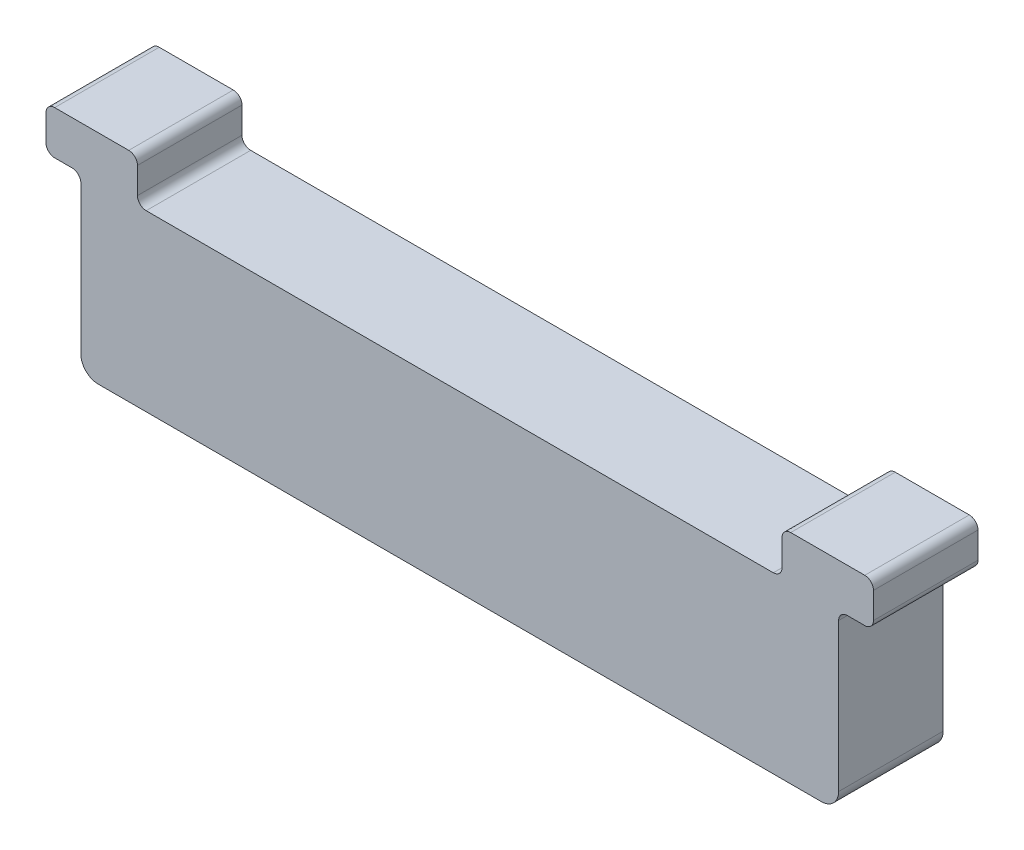
ISO-10303-21;
HEADER;
FILE_DESCRIPTION(('STEP AP214'),'2;1');
FILE_NAME('part.step','',(''),(''),'','','');
FILE_SCHEMA(('AUTOMOTIVE_DESIGN { 1 0 10303 214 1 1 1 1 }'));
ENDSEC;
DATA;
#1=APPLICATION_CONTEXT('core data for automotive mechanical design processes');
#2=APPLICATION_PROTOCOL_DEFINITION('international standard','automotive_design',2000,#1);
#3=PRODUCT_CONTEXT('',#1,'mechanical');
#4=PRODUCT('Part','Part','',(#3));
#5=PRODUCT_RELATED_PRODUCT_CATEGORY('part','',(#4));
#6=PRODUCT_DEFINITION_FORMATION('','',#4);
#7=PRODUCT_DEFINITION_CONTEXT('part definition',#1,'design');
#8=PRODUCT_DEFINITION('design','',#6,#7);
#9=PRODUCT_DEFINITION_SHAPE('','',#8);
#10=(LENGTH_UNIT() NAMED_UNIT(*) SI_UNIT(.MILLI.,.METRE.));
#11=(NAMED_UNIT(*) PLANE_ANGLE_UNIT() SI_UNIT($,.RADIAN.));
#12=(NAMED_UNIT(*) SI_UNIT($,.STERADIAN.) SOLID_ANGLE_UNIT());
#13=UNCERTAINTY_MEASURE_WITH_UNIT(LENGTH_MEASURE(1.E-05),#10,'distance_accuracy_value','');
#14=(GEOMETRIC_REPRESENTATION_CONTEXT(3) GLOBAL_UNCERTAINTY_ASSIGNED_CONTEXT((#13)) GLOBAL_UNIT_ASSIGNED_CONTEXT((#10,
#11,#12)) REPRESENTATION_CONTEXT('',''));
#15=CARTESIAN_POINT('',(0.,0.,0.));
#16=DIRECTION('',(0.,0.,1.));
#17=DIRECTION('',(1.,0.,0.));
#18=AXIS2_PLACEMENT_3D('',#15,#16,#17);
#19=CARTESIAN_POINT('',(20.75,1.,6.));
#20=DIRECTION('',(0.,0.,-1.));
#21=DIRECTION('',(-1.,0.,0.));
#22=AXIS2_PLACEMENT_3D('',#19,#20,#21);
#23=CYLINDRICAL_SURFACE('',#22,1.);
#24=CARTESIAN_POINT('',(20.75,1.,0.));
#25=DIRECTION('',(0.,0.,1.));
#26=DIRECTION('',(-1.,0.,0.));
#27=AXIS2_PLACEMENT_3D('',#24,#25,#26);
#28=CIRCLE('',#27,1.);
#29=CARTESIAN_POINT('',(20.75,0.,0.));
#30=VERTEX_POINT('',#29);
#31=CARTESIAN_POINT('',(21.75,1.,0.));
#32=VERTEX_POINT('',#31);
#33=EDGE_CURVE('E231',#30,#32,#28,.T.);
#34=ORIENTED_EDGE('',*,*,#33,.T.);
#35=DIRECTION('',(0.,0.,-1.));
#36=VECTOR('',#35,1.);
#37=CARTESIAN_POINT('',(21.75,1.,6.));
#38=LINE('',#37,#36);
#39=CARTESIAN_POINT('',(21.75,1.,6.));
#40=VERTEX_POINT('',#39);
#41=EDGE_CURVE('E11',#40,#32,#38,.T.);
#42=ORIENTED_EDGE('',*,*,#41,.F.);
#43=CARTESIAN_POINT('',(20.75,1.,6.));
#44=DIRECTION('',(0.,0.,1.));
#45=DIRECTION('',(-1.,0.,0.));
#46=AXIS2_PLACEMENT_3D('',#43,#44,#45);
#47=CIRCLE('',#46,1.);
#48=CARTESIAN_POINT('',(20.75,0.,6.));
#49=VERTEX_POINT('',#48);
#50=EDGE_CURVE('E277',#49,#40,#47,.T.);
#51=ORIENTED_EDGE('',*,*,#50,.F.);
#52=DIRECTION('',(0.,0.,-1.));
#53=VECTOR('',#52,1.);
#54=CARTESIAN_POINT('',(20.75,0.,6.));
#55=LINE('',#54,#53);
#56=EDGE_CURVE('E227',#49,#30,#55,.T.);
#57=ORIENTED_EDGE('',*,*,#56,.T.);
#58=EDGE_LOOP('',(#34,#42,#51,#57));
#59=FACE_BOUND('',#58,.T.);
#60=ADVANCED_FACE('F39',(#59),#23,.T.);
#61=CARTESIAN_POINT('',(21.75,9.5,6.));
#62=DIRECTION('',(-1.,0.,0.));
#63=DIRECTION('',(0.,0.,1.));
#64=AXIS2_PLACEMENT_3D('',#61,#62,#63);
#65=PLANE('',#64);
#66=DIRECTION('',(0.,1.,0.));
#67=VECTOR('',#66,1.);
#68=CARTESIAN_POINT('',(21.75,9.5,0.));
#69=LINE('',#68,#67);
#70=CARTESIAN_POINT('',(21.75,9.5,0.));
#71=VERTEX_POINT('',#70);
#72=EDGE_CURVE('E234',#32,#71,#69,.T.);
#73=ORIENTED_EDGE('',*,*,#72,.T.);
#74=DIRECTION('',(0.,0.,-1.));
#75=VECTOR('',#74,1.);
#76=CARTESIAN_POINT('',(21.75,9.5,6.));
#77=LINE('',#76,#75);
#78=CARTESIAN_POINT('',(21.75,9.5,6.));
#79=VERTEX_POINT('',#78);
#80=EDGE_CURVE('E47',#79,#71,#77,.T.);
#81=ORIENTED_EDGE('',*,*,#80,.F.);
#82=DIRECTION('',(0.,1.,0.));
#83=VECTOR('',#82,1.);
#84=CARTESIAN_POINT('',(21.75,9.5,6.));
#85=LINE('',#84,#83);
#86=EDGE_CURVE('E146',#40,#79,#85,.T.);
#87=ORIENTED_EDGE('',*,*,#86,.F.);
#88=ORIENTED_EDGE('',*,*,#41,.T.);
#89=EDGE_LOOP('',(#73,#81,#87,#88));
#90=FACE_BOUND('',#89,.T.);
#91=ADVANCED_FACE('F415',(#90),#65,.F.);
#92=CARTESIAN_POINT('',(22.25,9.5,6.));
#93=DIRECTION('',(0.,0.,-1.));
#94=DIRECTION('',(-1.,0.,0.));
#95=AXIS2_PLACEMENT_3D('',#92,#93,#94);
#96=CYLINDRICAL_SURFACE('',#95,0.5);
#97=CARTESIAN_POINT('',(22.25,9.5,0.));
#98=DIRECTION('',(0.,0.,-1.));
#99=DIRECTION('',(1.,0.,0.));
#100=AXIS2_PLACEMENT_3D('',#97,#98,#99);
#101=CIRCLE('',#100,0.5);
#102=CARTESIAN_POINT('',(22.25,10.,0.));
#103=VERTEX_POINT('',#102);
#104=EDGE_CURVE('E236',#71,#103,#101,.T.);
#105=ORIENTED_EDGE('',*,*,#104,.T.);
#106=DIRECTION('',(0.,0.,-1.));
#107=VECTOR('',#106,1.);
#108=CARTESIAN_POINT('',(22.25,10.,6.));
#109=LINE('',#108,#107);
#110=CARTESIAN_POINT('',(22.25,10.,6.));
#111=VERTEX_POINT('',#110);
#112=EDGE_CURVE('E332',#111,#103,#109,.T.);
#113=ORIENTED_EDGE('',*,*,#112,.F.);
#114=CARTESIAN_POINT('',(22.25,9.5,6.));
#115=DIRECTION('',(0.,0.,-1.));
#116=DIRECTION('',(1.,0.,0.));
#117=AXIS2_PLACEMENT_3D('',#114,#115,#116);
#118=CIRCLE('',#117,0.5);
#119=EDGE_CURVE('E340',#79,#111,#118,.T.);
#120=ORIENTED_EDGE('',*,*,#119,.F.);
#121=ORIENTED_EDGE('',*,*,#80,.T.);
#122=EDGE_LOOP('',(#105,#113,#120,#121));
#123=FACE_BOUND('',#122,.T.);
#124=ADVANCED_FACE('F338',(#123),#96,.F.);
#125=CARTESIAN_POINT('',(23.25,10.,6.));
#126=DIRECTION('',(0.,1.,0.));
#127=DIRECTION('',(0.,0.,1.));
#128=AXIS2_PLACEMENT_3D('',#125,#126,#127);
#129=PLANE('',#128);
#130=DIRECTION('',(1.,0.,0.));
#131=VECTOR('',#130,1.);
#132=CARTESIAN_POINT('',(23.25,10.,0.));
#133=LINE('',#132,#131);
#134=CARTESIAN_POINT('',(23.25,10.,0.));
#135=VERTEX_POINT('',#134);
#136=EDGE_CURVE('E238',#103,#135,#133,.T.);
#137=ORIENTED_EDGE('',*,*,#136,.T.);
#138=DIRECTION('',(0.,0.,-1.));
#139=VECTOR('',#138,1.);
#140=CARTESIAN_POINT('',(23.25,10.,6.));
#141=LINE('',#140,#139);
#142=CARTESIAN_POINT('',(23.25,10.,6.));
#143=VERTEX_POINT('',#142);
#144=EDGE_CURVE('E329',#143,#135,#141,.T.);
#145=ORIENTED_EDGE('',*,*,#144,.F.);
#146=DIRECTION('',(1.,0.,0.));
#147=VECTOR('',#146,1.);
#148=CARTESIAN_POINT('',(23.25,10.,6.));
#149=LINE('',#148,#147);
#150=EDGE_CURVE('E358',#111,#143,#149,.T.);
#151=ORIENTED_EDGE('',*,*,#150,.F.);
#152=ORIENTED_EDGE('',*,*,#112,.T.);
#153=EDGE_LOOP('',(#137,#145,#151,#152));
#154=FACE_BOUND('',#153,.T.);
#155=ADVANCED_FACE('F349',(#154),#129,.F.);
#156=CARTESIAN_POINT('',(23.25,10.5,6.));
#157=DIRECTION('',(0.,0.,-1.));
#158=DIRECTION('',(-1.,0.,0.));
#159=AXIS2_PLACEMENT_3D('',#156,#157,#158);
#160=CYLINDRICAL_SURFACE('',#159,0.5);
#161=CARTESIAN_POINT('',(23.25,10.5,0.));
#162=DIRECTION('',(0.,0.,1.));
#163=DIRECTION('',(1.,0.,0.));
#164=AXIS2_PLACEMENT_3D('',#161,#162,#163);
#165=CIRCLE('',#164,0.5);
#166=CARTESIAN_POINT('',(23.75,10.5,0.));
#167=VERTEX_POINT('',#166);
#168=EDGE_CURVE('E240',#135,#167,#165,.T.);
#169=ORIENTED_EDGE('',*,*,#168,.T.);
#170=DIRECTION('',(0.,0.,-1.));
#171=VECTOR('',#170,1.);
#172=CARTESIAN_POINT('',(23.75,10.5,6.));
#173=LINE('',#172,#171);
#174=CARTESIAN_POINT('',(23.75,10.5,6.));
#175=VERTEX_POINT('',#174);
#176=EDGE_CURVE('E326',#175,#167,#173,.T.);
#177=ORIENTED_EDGE('',*,*,#176,.F.);
#178=CARTESIAN_POINT('',(23.25,10.5,6.));
#179=DIRECTION('',(0.,0.,1.));
#180=DIRECTION('',(1.,0.,0.));
#181=AXIS2_PLACEMENT_3D('',#178,#179,#180);
#182=CIRCLE('',#181,0.5);
#183=EDGE_CURVE('E355',#143,#175,#182,.T.);
#184=ORIENTED_EDGE('',*,*,#183,.F.);
#185=ORIENTED_EDGE('',*,*,#144,.T.);
#186=EDGE_LOOP('',(#169,#177,#184,#185));
#187=FACE_BOUND('',#186,.T.);
#188=ADVANCED_FACE('F353',(#187),#160,.T.);
#189=CARTESIAN_POINT('',(23.75,10.5,6.));
#190=DIRECTION('',(-1.,0.,0.));
#191=DIRECTION('',(0.,0.,1.));
#192=AXIS2_PLACEMENT_3D('',#189,#190,#191);
#193=PLANE('',#192);
#194=DIRECTION('',(0.,1.,0.));
#195=VECTOR('',#194,1.);
#196=CARTESIAN_POINT('',(23.75,10.5,0.));
#197=LINE('',#196,#195);
#198=CARTESIAN_POINT('',(23.75,12.,0.));
#199=VERTEX_POINT('',#198);
#200=EDGE_CURVE('E242',#167,#199,#197,.T.);
#201=ORIENTED_EDGE('',*,*,#200,.T.);
#202=DIRECTION('',(0.,0.,-1.));
#203=VECTOR('',#202,1.);
#204=CARTESIAN_POINT('',(23.75,12.,6.));
#205=LINE('',#204,#203);
#206=CARTESIAN_POINT('',(23.75,12.,6.));
#207=VERTEX_POINT('',#206);
#208=EDGE_CURVE('E323',#207,#199,#205,.T.);
#209=ORIENTED_EDGE('',*,*,#208,.F.);
#210=DIRECTION('',(0.,1.,0.));
#211=VECTOR('',#210,1.);
#212=CARTESIAN_POINT('',(23.75,10.5,6.));
#213=LINE('',#212,#211);
#214=EDGE_CURVE('E357',#175,#207,#213,.T.);
#215=ORIENTED_EDGE('',*,*,#214,.F.);
#216=ORIENTED_EDGE('',*,*,#176,.T.);
#217=EDGE_LOOP('',(#201,#209,#215,#216));
#218=FACE_BOUND('',#217,.T.);
#219=ADVANCED_FACE('F428',(#218),#193,.F.);
#220=CARTESIAN_POINT('',(23.25,12.,6.));
#221=DIRECTION('',(0.,0.,-1.));
#222=DIRECTION('',(-1.,0.,0.));
#223=AXIS2_PLACEMENT_3D('',#220,#221,#222);
#224=CYLINDRICAL_SURFACE('',#223,0.5);
#225=CARTESIAN_POINT('',(23.25,12.,0.));
#226=DIRECTION('',(0.,0.,1.));
#227=DIRECTION('',(1.,0.,0.));
#228=AXIS2_PLACEMENT_3D('',#225,#226,#227);
#229=CIRCLE('',#228,0.5);
#230=CARTESIAN_POINT('',(23.25,12.5,0.));
#231=VERTEX_POINT('',#230);
#232=EDGE_CURVE('E244',#199,#231,#229,.T.);
#233=ORIENTED_EDGE('',*,*,#232,.T.);
#234=DIRECTION('',(0.,0.,-1.));
#235=VECTOR('',#234,1.);
#236=CARTESIAN_POINT('',(23.25,12.5,6.));
#237=LINE('',#236,#235);
#238=CARTESIAN_POINT('',(23.25,12.5,6.));
#239=VERTEX_POINT('',#238);
#240=EDGE_CURVE('E320',#239,#231,#237,.T.);
#241=ORIENTED_EDGE('',*,*,#240,.F.);
#242=CARTESIAN_POINT('',(23.25,12.,6.));
#243=DIRECTION('',(0.,0.,1.));
#244=DIRECTION('',(1.,0.,0.));
#245=AXIS2_PLACEMENT_3D('',#242,#243,#244);
#246=CIRCLE('',#245,0.5);
#247=EDGE_CURVE('E360',#207,#239,#246,.T.);
#248=ORIENTED_EDGE('',*,*,#247,.F.);
#249=ORIENTED_EDGE('',*,*,#208,.T.);
#250=EDGE_LOOP('',(#233,#241,#248,#249));
#251=FACE_BOUND('',#250,.T.);
#252=ADVANCED_FACE('F431',(#251),#224,.T.);
#253=CARTESIAN_POINT('',(23.25,12.5,6.));
#254=DIRECTION('',(0.,-1.,0.));
#255=DIRECTION('',(0.,0.,-1.));
#256=AXIS2_PLACEMENT_3D('',#253,#254,#255);
#257=PLANE('',#256);
#258=DIRECTION('',(-1.,0.,0.));
#259=VECTOR('',#258,1.);
#260=CARTESIAN_POINT('',(23.25,12.5,0.));
#261=LINE('',#260,#259);
#262=CARTESIAN_POINT('',(19.,12.5,0.));
#263=VERTEX_POINT('',#262);
#264=EDGE_CURVE('E246',#231,#263,#261,.T.);
#265=ORIENTED_EDGE('',*,*,#264,.T.);
#266=DIRECTION('',(0.,0.,-1.));
#267=VECTOR('',#266,1.);
#268=CARTESIAN_POINT('',(19.,12.5,6.));
#269=LINE('',#268,#267);
#270=CARTESIAN_POINT('',(19.,12.5,6.));
#271=VERTEX_POINT('',#270);
#272=EDGE_CURVE('E317',#271,#263,#269,.T.);
#273=ORIENTED_EDGE('',*,*,#272,.F.);
#274=DIRECTION('',(-1.,0.,0.));
#275=VECTOR('',#274,1.);
#276=CARTESIAN_POINT('',(23.25,12.5,6.));
#277=LINE('',#276,#275);
#278=EDGE_CURVE('E366',#239,#271,#277,.T.);
#279=ORIENTED_EDGE('',*,*,#278,.F.);
#280=ORIENTED_EDGE('',*,*,#240,.T.);
#281=EDGE_LOOP('',(#265,#273,#279,#280));
#282=FACE_BOUND('',#281,.T.);
#283=ADVANCED_FACE('F435',(#282),#257,.F.);
#284=CARTESIAN_POINT('',(19.,12.,6.));
#285=DIRECTION('',(0.,0.,-1.));
#286=DIRECTION('',(-1.,0.,0.));
#287=AXIS2_PLACEMENT_3D('',#284,#285,#286);
#288=CYLINDRICAL_SURFACE('',#287,0.5);
#289=CARTESIAN_POINT('',(19.,12.,0.));
#290=DIRECTION('',(0.,0.,1.));
#291=DIRECTION('',(1.,0.,0.));
#292=AXIS2_PLACEMENT_3D('',#289,#290,#291);
#293=CIRCLE('',#292,0.5);
#294=CARTESIAN_POINT('',(18.5,12.,0.));
#295=VERTEX_POINT('',#294);
#296=EDGE_CURVE('E248',#263,#295,#293,.T.);
#297=ORIENTED_EDGE('',*,*,#296,.T.);
#298=DIRECTION('',(0.,0.,-1.));
#299=VECTOR('',#298,1.);
#300=CARTESIAN_POINT('',(18.5,12.,6.));
#301=LINE('',#300,#299);
#302=CARTESIAN_POINT('',(18.5,12.,6.));
#303=VERTEX_POINT('',#302);
#304=EDGE_CURVE('E314',#303,#295,#301,.T.);
#305=ORIENTED_EDGE('',*,*,#304,.F.);
#306=CARTESIAN_POINT('',(19.,12.,6.));
#307=DIRECTION('',(0.,0.,1.));
#308=DIRECTION('',(1.,0.,0.));
#309=AXIS2_PLACEMENT_3D('',#306,#307,#308);
#310=CIRCLE('',#309,0.5);
#311=EDGE_CURVE('E368',#271,#303,#310,.T.);
#312=ORIENTED_EDGE('',*,*,#311,.F.);
#313=ORIENTED_EDGE('',*,*,#272,.T.);
#314=EDGE_LOOP('',(#297,#305,#312,#313));
#315=FACE_BOUND('',#314,.T.);
#316=ADVANCED_FACE('F439',(#315),#288,.T.);
#317=CARTESIAN_POINT('',(18.5,12.,6.));
#318=DIRECTION('',(1.,0.,0.));
#319=DIRECTION('',(0.,0.,-1.));
#320=AXIS2_PLACEMENT_3D('',#317,#318,#319);
#321=PLANE('',#320);
#322=DIRECTION('',(0.,-1.,0.));
#323=VECTOR('',#322,1.);
#324=CARTESIAN_POINT('',(18.5,12.,0.));
#325=LINE('',#324,#323);
#326=CARTESIAN_POINT('',(18.5,10.5,0.));
#327=VERTEX_POINT('',#326);
#328=EDGE_CURVE('E250',#295,#327,#325,.T.);
#329=ORIENTED_EDGE('',*,*,#328,.T.);
#330=DIRECTION('',(0.,0.,-1.));
#331=VECTOR('',#330,1.);
#332=CARTESIAN_POINT('',(18.5,10.5,6.));
#333=LINE('',#332,#331);
#334=CARTESIAN_POINT('',(18.5,10.5,6.));
#335=VERTEX_POINT('',#334);
#336=EDGE_CURVE('E311',#335,#327,#333,.T.);
#337=ORIENTED_EDGE('',*,*,#336,.F.);
#338=DIRECTION('',(0.,-1.,0.));
#339=VECTOR('',#338,1.);
#340=CARTESIAN_POINT('',(18.5,12.,6.));
#341=LINE('',#340,#339);
#342=EDGE_CURVE('E370',#303,#335,#341,.T.);
#343=ORIENTED_EDGE('',*,*,#342,.F.);
#344=ORIENTED_EDGE('',*,*,#304,.T.);
#345=EDGE_LOOP('',(#329,#337,#343,#344));
#346=FACE_BOUND('',#345,.T.);
#347=ADVANCED_FACE('F443',(#346),#321,.F.);
#348=CARTESIAN_POINT('',(18.,10.5,6.));
#349=DIRECTION('',(0.,0.,-1.));
#350=DIRECTION('',(-1.,0.,0.));
#351=AXIS2_PLACEMENT_3D('',#348,#349,#350);
#352=CYLINDRICAL_SURFACE('',#351,0.5);
#353=CARTESIAN_POINT('',(18.,10.5,0.));
#354=DIRECTION('',(0.,0.,-1.));
#355=DIRECTION('',(-1.,0.,0.));
#356=AXIS2_PLACEMENT_3D('',#353,#354,#355);
#357=CIRCLE('',#356,0.5);
#358=CARTESIAN_POINT('',(18.,10.,0.));
#359=VERTEX_POINT('',#358);
#360=EDGE_CURVE('E252',#327,#359,#357,.T.);
#361=ORIENTED_EDGE('',*,*,#360,.T.);
#362=DIRECTION('',(0.,0.,-1.));
#363=VECTOR('',#362,1.);
#364=CARTESIAN_POINT('',(18.,10.,6.));
#365=LINE('',#364,#363);
#366=CARTESIAN_POINT('',(18.,10.,6.));
#367=VERTEX_POINT('',#366);
#368=EDGE_CURVE('E308',#367,#359,#365,.T.);
#369=ORIENTED_EDGE('',*,*,#368,.F.);
#370=CARTESIAN_POINT('',(18.,10.5,6.));
#371=DIRECTION('',(0.,0.,-1.));
#372=DIRECTION('',(-1.,0.,0.));
#373=AXIS2_PLACEMENT_3D('',#370,#371,#372);
#374=CIRCLE('',#373,0.5);
#375=EDGE_CURVE('E372',#335,#367,#374,.T.);
#376=ORIENTED_EDGE('',*,*,#375,.F.);
#377=ORIENTED_EDGE('',*,*,#336,.T.);
#378=EDGE_LOOP('',(#361,#369,#376,#377));
#379=FACE_BOUND('',#378,.T.);
#380=ADVANCED_FACE('F447',(#379),#352,.F.);
#381=CARTESIAN_POINT('',(18.,10.,6.));
#382=DIRECTION('',(0.,-1.,0.));
#383=DIRECTION('',(0.,0.,-1.));
#384=AXIS2_PLACEMENT_3D('',#381,#382,#383);
#385=PLANE('',#384);
#386=DIRECTION('',(-1.,0.,0.));
#387=VECTOR('',#386,1.);
#388=CARTESIAN_POINT('',(18.,10.,0.));
#389=LINE('',#388,#387);
#390=CARTESIAN_POINT('',(-18.,10.,0.));
#391=VERTEX_POINT('',#390);
#392=EDGE_CURVE('E254',#359,#391,#389,.T.);
#393=ORIENTED_EDGE('',*,*,#392,.T.);
#394=DIRECTION('',(0.,0.,-1.));
#395=VECTOR('',#394,1.);
#396=CARTESIAN_POINT('',(-18.,10.,6.));
#397=LINE('',#396,#395);
#398=CARTESIAN_POINT('',(-18.,10.,6.));
#399=VERTEX_POINT('',#398);
#400=EDGE_CURVE('E305',#399,#391,#397,.T.);
#401=ORIENTED_EDGE('',*,*,#400,.F.);
#402=DIRECTION('',(-1.,0.,0.));
#403=VECTOR('',#402,1.);
#404=CARTESIAN_POINT('',(18.,10.,6.));
#405=LINE('',#404,#403);
#406=EDGE_CURVE('E374',#367,#399,#405,.T.);
#407=ORIENTED_EDGE('',*,*,#406,.F.);
#408=ORIENTED_EDGE('',*,*,#368,.T.);
#409=EDGE_LOOP('',(#393,#401,#407,#408));
#410=FACE_BOUND('',#409,.T.);
#411=ADVANCED_FACE('F451',(#410),#385,.F.);
#412=CARTESIAN_POINT('',(-18.,10.5,6.));
#413=DIRECTION('',(0.,0.,-1.));
#414=DIRECTION('',(-1.,0.,0.));
#415=AXIS2_PLACEMENT_3D('',#412,#413,#414);
#416=CYLINDRICAL_SURFACE('',#415,0.5);
#417=CARTESIAN_POINT('',(-18.,10.5,0.));
#418=DIRECTION('',(0.,0.,-1.));
#419=DIRECTION('',(1.,0.,0.));
#420=AXIS2_PLACEMENT_3D('',#417,#418,#419);
#421=CIRCLE('',#420,0.5);
#422=CARTESIAN_POINT('',(-18.5,10.5,0.));
#423=VERTEX_POINT('',#422);
#424=EDGE_CURVE('E256',#391,#423,#421,.T.);
#425=ORIENTED_EDGE('',*,*,#424,.T.);
#426=DIRECTION('',(0.,0.,-1.));
#427=VECTOR('',#426,1.);
#428=CARTESIAN_POINT('',(-18.5,10.5,6.));
#429=LINE('',#428,#427);
#430=CARTESIAN_POINT('',(-18.5,10.5,6.));
#431=VERTEX_POINT('',#430);
#432=EDGE_CURVE('E302',#431,#423,#429,.T.);
#433=ORIENTED_EDGE('',*,*,#432,.F.);
#434=CARTESIAN_POINT('',(-18.,10.5,6.));
#435=DIRECTION('',(0.,0.,-1.));
#436=DIRECTION('',(1.,0.,0.));
#437=AXIS2_PLACEMENT_3D('',#434,#435,#436);
#438=CIRCLE('',#437,0.5);
#439=EDGE_CURVE('E376',#399,#431,#438,.T.);
#440=ORIENTED_EDGE('',*,*,#439,.F.);
#441=ORIENTED_EDGE('',*,*,#400,.T.);
#442=EDGE_LOOP('',(#425,#433,#440,#441));
#443=FACE_BOUND('',#442,.T.);
#444=ADVANCED_FACE('F455',(#443),#416,.F.);
#445=CARTESIAN_POINT('',(-18.5,12.,6.));
#446=DIRECTION('',(-1.,0.,0.));
#447=DIRECTION('',(0.,0.,1.));
#448=AXIS2_PLACEMENT_3D('',#445,#446,#447);
#449=PLANE('',#448);
#450=DIRECTION('',(0.,1.,0.));
#451=VECTOR('',#450,1.);
#452=CARTESIAN_POINT('',(-18.5,12.,0.));
#453=LINE('',#452,#451);
#454=CARTESIAN_POINT('',(-18.5,12.,0.));
#455=VERTEX_POINT('',#454);
#456=EDGE_CURVE('E258',#423,#455,#453,.T.);
#457=ORIENTED_EDGE('',*,*,#456,.T.);
#458=DIRECTION('',(0.,0.,-1.));
#459=VECTOR('',#458,1.);
#460=CARTESIAN_POINT('',(-18.5,12.,6.));
#461=LINE('',#460,#459);
#462=CARTESIAN_POINT('',(-18.5,12.,6.));
#463=VERTEX_POINT('',#462);
#464=EDGE_CURVE('E299',#463,#455,#461,.T.);
#465=ORIENTED_EDGE('',*,*,#464,.F.);
#466=DIRECTION('',(0.,1.,0.));
#467=VECTOR('',#466,1.);
#468=CARTESIAN_POINT('',(-18.5,12.,6.));
#469=LINE('',#468,#467);
#470=EDGE_CURVE('E378',#431,#463,#469,.T.);
#471=ORIENTED_EDGE('',*,*,#470,.F.);
#472=ORIENTED_EDGE('',*,*,#432,.T.);
#473=EDGE_LOOP('',(#457,#465,#471,#472));
#474=FACE_BOUND('',#473,.T.);
#475=ADVANCED_FACE('F459',(#474),#449,.F.);
#476=CARTESIAN_POINT('',(-19.,12.,6.));
#477=DIRECTION('',(0.,0.,-1.));
#478=DIRECTION('',(-1.,0.,0.));
#479=AXIS2_PLACEMENT_3D('',#476,#477,#478);
#480=CYLINDRICAL_SURFACE('',#479,0.5);
#481=CARTESIAN_POINT('',(-19.,12.,0.));
#482=DIRECTION('',(0.,0.,1.));
#483=DIRECTION('',(1.,0.,0.));
#484=AXIS2_PLACEMENT_3D('',#481,#482,#483);
#485=CIRCLE('',#484,0.5);
#486=CARTESIAN_POINT('',(-19.,12.5,0.));
#487=VERTEX_POINT('',#486);
#488=EDGE_CURVE('E260',#455,#487,#485,.T.);
#489=ORIENTED_EDGE('',*,*,#488,.T.);
#490=DIRECTION('',(0.,0.,-1.));
#491=VECTOR('',#490,1.);
#492=CARTESIAN_POINT('',(-19.,12.5,6.));
#493=LINE('',#492,#491);
#494=CARTESIAN_POINT('',(-19.,12.5,6.));
#495=VERTEX_POINT('',#494);
#496=EDGE_CURVE('E296',#495,#487,#493,.T.);
#497=ORIENTED_EDGE('',*,*,#496,.F.);
#498=CARTESIAN_POINT('',(-19.,12.,6.));
#499=DIRECTION('',(0.,0.,1.));
#500=DIRECTION('',(1.,0.,0.));
#501=AXIS2_PLACEMENT_3D('',#498,#499,#500);
#502=CIRCLE('',#501,0.5);
#503=EDGE_CURVE('E380',#463,#495,#502,.T.);
#504=ORIENTED_EDGE('',*,*,#503,.F.);
#505=ORIENTED_EDGE('',*,*,#464,.T.);
#506=EDGE_LOOP('',(#489,#497,#504,#505));
#507=FACE_BOUND('',#506,.T.);
#508=ADVANCED_FACE('F463',(#507),#480,.T.);
#509=CARTESIAN_POINT('',(-23.25,12.5,6.));
#510=DIRECTION('',(0.,-1.,0.));
#511=DIRECTION('',(0.,0.,-1.));
#512=AXIS2_PLACEMENT_3D('',#509,#510,#511);
#513=PLANE('',#512);
#514=DIRECTION('',(-1.,0.,0.));
#515=VECTOR('',#514,1.);
#516=CARTESIAN_POINT('',(-23.25,12.5,0.));
#517=LINE('',#516,#515);
#518=CARTESIAN_POINT('',(-23.25,12.5,0.));
#519=VERTEX_POINT('',#518);
#520=EDGE_CURVE('E262',#487,#519,#517,.T.);
#521=ORIENTED_EDGE('',*,*,#520,.T.);
#522=DIRECTION('',(0.,0.,-1.));
#523=VECTOR('',#522,1.);
#524=CARTESIAN_POINT('',(-23.25,12.5,6.));
#525=LINE('',#524,#523);
#526=CARTESIAN_POINT('',(-23.25,12.5,6.));
#527=VERTEX_POINT('',#526);
#528=EDGE_CURVE('E293',#527,#519,#525,.T.);
#529=ORIENTED_EDGE('',*,*,#528,.F.);
#530=DIRECTION('',(-1.,0.,0.));
#531=VECTOR('',#530,1.);
#532=CARTESIAN_POINT('',(-23.25,12.5,6.));
#533=LINE('',#532,#531);
#534=EDGE_CURVE('E382',#495,#527,#533,.T.);
#535=ORIENTED_EDGE('',*,*,#534,.F.);
#536=ORIENTED_EDGE('',*,*,#496,.T.);
#537=EDGE_LOOP('',(#521,#529,#535,#536));
#538=FACE_BOUND('',#537,.T.);
#539=ADVANCED_FACE('F467',(#538),#513,.F.);
#540=CARTESIAN_POINT('',(-23.25,12.,6.));
#541=DIRECTION('',(0.,0.,-1.));
#542=DIRECTION('',(-1.,0.,0.));
#543=AXIS2_PLACEMENT_3D('',#540,#541,#542);
#544=CYLINDRICAL_SURFACE('',#543,0.5);
#545=CARTESIAN_POINT('',(-23.25,12.,0.));
#546=DIRECTION('',(0.,0.,1.));
#547=DIRECTION('',(1.,0.,0.));
#548=AXIS2_PLACEMENT_3D('',#545,#546,#547);
#549=CIRCLE('',#548,0.5);
#550=CARTESIAN_POINT('',(-23.75,12.,0.));
#551=VERTEX_POINT('',#550);
#552=EDGE_CURVE('E264',#519,#551,#549,.T.);
#553=ORIENTED_EDGE('',*,*,#552,.T.);
#554=DIRECTION('',(0.,0.,-1.));
#555=VECTOR('',#554,1.);
#556=CARTESIAN_POINT('',(-23.75,12.,6.));
#557=LINE('',#556,#555);
#558=CARTESIAN_POINT('',(-23.75,12.,6.));
#559=VERTEX_POINT('',#558);
#560=EDGE_CURVE('E290',#559,#551,#557,.T.);
#561=ORIENTED_EDGE('',*,*,#560,.F.);
#562=CARTESIAN_POINT('',(-23.25,12.,6.));
#563=DIRECTION('',(0.,0.,1.));
#564=DIRECTION('',(1.,0.,0.));
#565=AXIS2_PLACEMENT_3D('',#562,#563,#564);
#566=CIRCLE('',#565,0.5);
#567=EDGE_CURVE('E384',#527,#559,#566,.T.);
#568=ORIENTED_EDGE('',*,*,#567,.F.);
#569=ORIENTED_EDGE('',*,*,#528,.T.);
#570=EDGE_LOOP('',(#553,#561,#568,#569));
#571=FACE_BOUND('',#570,.T.);
#572=ADVANCED_FACE('F471',(#571),#544,.T.);
#573=CARTESIAN_POINT('',(-23.75,10.5,6.));
#574=DIRECTION('',(1.,0.,0.));
#575=DIRECTION('',(0.,0.,-1.));
#576=AXIS2_PLACEMENT_3D('',#573,#574,#575);
#577=PLANE('',#576);
#578=DIRECTION('',(0.,-1.,0.));
#579=VECTOR('',#578,1.);
#580=CARTESIAN_POINT('',(-23.75,10.5,0.));
#581=LINE('',#580,#579);
#582=CARTESIAN_POINT('',(-23.75,10.5,0.));
#583=VERTEX_POINT('',#582);
#584=EDGE_CURVE('E266',#551,#583,#581,.T.);
#585=ORIENTED_EDGE('',*,*,#584,.T.);
#586=DIRECTION('',(0.,0.,-1.));
#587=VECTOR('',#586,1.);
#588=CARTESIAN_POINT('',(-23.75,10.5,6.));
#589=LINE('',#588,#587);
#590=CARTESIAN_POINT('',(-23.75,10.5,6.));
#591=VERTEX_POINT('',#590);
#592=EDGE_CURVE('E287',#591,#583,#589,.T.);
#593=ORIENTED_EDGE('',*,*,#592,.F.);
#594=DIRECTION('',(0.,-1.,0.));
#595=VECTOR('',#594,1.);
#596=CARTESIAN_POINT('',(-23.75,10.5,6.));
#597=LINE('',#596,#595);
#598=EDGE_CURVE('E386',#559,#591,#597,.T.);
#599=ORIENTED_EDGE('',*,*,#598,.F.);
#600=ORIENTED_EDGE('',*,*,#560,.T.);
#601=EDGE_LOOP('',(#585,#593,#599,#600));
#602=FACE_BOUND('',#601,.T.);
#603=ADVANCED_FACE('F475',(#602),#577,.F.);
#604=CARTESIAN_POINT('',(-23.25,10.5,6.));
#605=DIRECTION('',(0.,0.,-1.));
#606=DIRECTION('',(-1.,0.,0.));
#607=AXIS2_PLACEMENT_3D('',#604,#605,#606);
#608=CYLINDRICAL_SURFACE('',#607,0.5);
#609=CARTESIAN_POINT('',(-23.25,10.5,0.));
#610=DIRECTION('',(0.,0.,1.));
#611=DIRECTION('',(-1.,0.,0.));
#612=AXIS2_PLACEMENT_3D('',#609,#610,#611);
#613=CIRCLE('',#612,0.5);
#614=CARTESIAN_POINT('',(-23.25,10.,0.));
#615=VERTEX_POINT('',#614);
#616=EDGE_CURVE('E268',#583,#615,#613,.T.);
#617=ORIENTED_EDGE('',*,*,#616,.T.);
#618=DIRECTION('',(0.,0.,-1.));
#619=VECTOR('',#618,1.);
#620=CARTESIAN_POINT('',(-23.25,10.,6.));
#621=LINE('',#620,#619);
#622=CARTESIAN_POINT('',(-23.25,10.,6.));
#623=VERTEX_POINT('',#622);
#624=EDGE_CURVE('E284',#623,#615,#621,.T.);
#625=ORIENTED_EDGE('',*,*,#624,.F.);
#626=CARTESIAN_POINT('',(-23.25,10.5,6.));
#627=DIRECTION('',(0.,0.,1.));
#628=DIRECTION('',(-1.,0.,0.));
#629=AXIS2_PLACEMENT_3D('',#626,#627,#628);
#630=CIRCLE('',#629,0.5);
#631=EDGE_CURVE('E388',#591,#623,#630,.T.);
#632=ORIENTED_EDGE('',*,*,#631,.F.);
#633=ORIENTED_EDGE('',*,*,#592,.T.);
#634=EDGE_LOOP('',(#617,#625,#632,#633));
#635=FACE_BOUND('',#634,.T.);
#636=ADVANCED_FACE('F479',(#635),#608,.T.);
#637=CARTESIAN_POINT('',(-23.25,10.,6.));
#638=DIRECTION('',(0.,1.,0.));
#639=DIRECTION('',(0.,0.,1.));
#640=AXIS2_PLACEMENT_3D('',#637,#638,#639);
#641=PLANE('',#640);
#642=DIRECTION('',(1.,0.,0.));
#643=VECTOR('',#642,1.);
#644=CARTESIAN_POINT('',(-23.25,10.,0.));
#645=LINE('',#644,#643);
#646=CARTESIAN_POINT('',(-22.25,10.,0.));
#647=VERTEX_POINT('',#646);
#648=EDGE_CURVE('E270',#615,#647,#645,.T.);
#649=ORIENTED_EDGE('',*,*,#648,.T.);
#650=DIRECTION('',(0.,0.,-1.));
#651=VECTOR('',#650,1.);
#652=CARTESIAN_POINT('',(-22.25,10.,6.));
#653=LINE('',#652,#651);
#654=CARTESIAN_POINT('',(-22.25,10.,6.));
#655=VERTEX_POINT('',#654);
#656=EDGE_CURVE('E281',#655,#647,#653,.T.);
#657=ORIENTED_EDGE('',*,*,#656,.F.);
#658=DIRECTION('',(1.,0.,0.));
#659=VECTOR('',#658,1.);
#660=CARTESIAN_POINT('',(-23.25,10.,6.));
#661=LINE('',#660,#659);
#662=EDGE_CURVE('E390',#623,#655,#661,.T.);
#663=ORIENTED_EDGE('',*,*,#662,.F.);
#664=ORIENTED_EDGE('',*,*,#624,.T.);
#665=EDGE_LOOP('',(#649,#657,#663,#664));
#666=FACE_BOUND('',#665,.T.);
#667=ADVANCED_FACE('F396',(#666),#641,.F.);
#668=CARTESIAN_POINT('',(-22.25,9.5,6.));
#669=DIRECTION('',(0.,0.,-1.));
#670=DIRECTION('',(-1.,0.,0.));
#671=AXIS2_PLACEMENT_3D('',#668,#669,#670);
#672=CYLINDRICAL_SURFACE('',#671,0.5);
#673=CARTESIAN_POINT('',(-22.25,9.5,0.));
#674=DIRECTION('',(0.,0.,-1.));
#675=DIRECTION('',(1.,0.,0.));
#676=AXIS2_PLACEMENT_3D('',#673,#674,#675);
#677=CIRCLE('',#676,0.5);
#678=CARTESIAN_POINT('',(-21.75,9.5,0.));
#679=VERTEX_POINT('',#678);
#680=EDGE_CURVE('E272',#647,#679,#677,.T.);
#681=ORIENTED_EDGE('',*,*,#680,.T.);
#682=DIRECTION('',(0.,0.,-1.));
#683=VECTOR('',#682,1.);
#684=CARTESIAN_POINT('',(-21.75,9.5,6.));
#685=LINE('',#684,#683);
#686=CARTESIAN_POINT('',(-21.75,9.5,6.));
#687=VERTEX_POINT('',#686);
#688=EDGE_CURVE('E222',#687,#679,#685,.T.);
#689=ORIENTED_EDGE('',*,*,#688,.F.);
#690=CARTESIAN_POINT('',(-22.25,9.5,6.));
#691=DIRECTION('',(0.,0.,-1.));
#692=DIRECTION('',(1.,0.,0.));
#693=AXIS2_PLACEMENT_3D('',#690,#691,#692);
#694=CIRCLE('',#693,0.5);
#695=EDGE_CURVE('E213',#655,#687,#694,.T.);
#696=ORIENTED_EDGE('',*,*,#695,.F.);
#697=ORIENTED_EDGE('',*,*,#656,.T.);
#698=EDGE_LOOP('',(#681,#689,#696,#697));
#699=FACE_BOUND('',#698,.T.);
#700=ADVANCED_FACE('F400',(#699),#672,.F.);
#701=CARTESIAN_POINT('',(-21.75,9.5,6.));
#702=DIRECTION('',(1.,0.,0.));
#703=DIRECTION('',(0.,0.,-1.));
#704=AXIS2_PLACEMENT_3D('',#701,#702,#703);
#705=PLANE('',#704);
#706=DIRECTION('',(0.,-1.,0.));
#707=VECTOR('',#706,1.);
#708=CARTESIAN_POINT('',(-21.75,9.5,0.));
#709=LINE('',#708,#707);
#710=CARTESIAN_POINT('',(-21.75,1.,0.));
#711=VERTEX_POINT('',#710);
#712=EDGE_CURVE('E221',#679,#711,#709,.T.);
#713=ORIENTED_EDGE('',*,*,#712,.T.);
#714=DIRECTION('',(0.,0.,-1.));
#715=VECTOR('',#714,1.);
#716=CARTESIAN_POINT('',(-21.75,1.,6.));
#717=LINE('',#716,#715);
#718=CARTESIAN_POINT('',(-21.75,1.,6.));
#719=VERTEX_POINT('',#718);
#720=EDGE_CURVE('E218',#719,#711,#717,.T.);
#721=ORIENTED_EDGE('',*,*,#720,.F.);
#722=DIRECTION('',(0.,-1.,0.));
#723=VECTOR('',#722,1.);
#724=CARTESIAN_POINT('',(-21.75,9.5,6.));
#725=LINE('',#724,#723);
#726=EDGE_CURVE('E207',#687,#719,#725,.T.);
#727=ORIENTED_EDGE('',*,*,#726,.F.);
#728=ORIENTED_EDGE('',*,*,#688,.T.);
#729=EDGE_LOOP('',(#713,#721,#727,#728));
#730=FACE_BOUND('',#729,.T.);
#731=ADVANCED_FACE('F219',(#730),#705,.F.);
#732=CARTESIAN_POINT('',(-20.75,1.,6.));
#733=DIRECTION('',(0.,0.,-1.));
#734=DIRECTION('',(-1.,0.,0.));
#735=AXIS2_PLACEMENT_3D('',#732,#733,#734);
#736=CYLINDRICAL_SURFACE('',#735,1.);
#737=CARTESIAN_POINT('',(-20.75,1.,0.));
#738=DIRECTION('',(0.,0.,1.));
#739=DIRECTION('',(1.,0.,0.));
#740=AXIS2_PLACEMENT_3D('',#737,#738,#739);
#741=CIRCLE('',#740,1.);
#742=CARTESIAN_POINT('',(-20.75,0.,0.));
#743=VERTEX_POINT('',#742);
#744=EDGE_CURVE('E132',#711,#743,#741,.T.);
#745=ORIENTED_EDGE('',*,*,#744,.T.);
#746=DIRECTION('',(0.,0.,-1.));
#747=VECTOR('',#746,1.);
#748=CARTESIAN_POINT('',(-20.75,0.,6.));
#749=LINE('',#748,#747);
#750=CARTESIAN_POINT('',(-20.75,0.,6.));
#751=VERTEX_POINT('',#750);
#752=EDGE_CURVE('E223',#751,#743,#749,.T.);
#753=ORIENTED_EDGE('',*,*,#752,.F.);
#754=CARTESIAN_POINT('',(-20.75,1.,6.));
#755=DIRECTION('',(0.,0.,1.));
#756=DIRECTION('',(1.,0.,0.));
#757=AXIS2_PLACEMENT_3D('',#754,#755,#756);
#758=CIRCLE('',#757,1.);
#759=EDGE_CURVE('E211',#719,#751,#758,.T.);
#760=ORIENTED_EDGE('',*,*,#759,.F.);
#761=ORIENTED_EDGE('',*,*,#720,.T.);
#762=EDGE_LOOP('',(#745,#753,#760,#761));
#763=FACE_BOUND('',#762,.T.);
#764=ADVANCED_FACE('F225',(#763),#736,.T.);
#765=CARTESIAN_POINT('',(-20.75,0.,6.));
#766=DIRECTION('',(0.,1.,0.));
#767=DIRECTION('',(0.,0.,1.));
#768=AXIS2_PLACEMENT_3D('',#765,#766,#767);
#769=PLANE('',#768);
#770=DIRECTION('',(1.,0.,0.));
#771=VECTOR('',#770,1.);
#772=CARTESIAN_POINT('',(-20.75,0.,0.));
#773=LINE('',#772,#771);
#774=EDGE_CURVE('E138',#743,#30,#773,.T.);
#775=ORIENTED_EDGE('',*,*,#774,.T.);
#776=ORIENTED_EDGE('',*,*,#56,.F.);
#777=DIRECTION('',(1.,0.,0.));
#778=VECTOR('',#777,1.);
#779=CARTESIAN_POINT('',(-20.75,0.,6.));
#780=LINE('',#779,#778);
#781=EDGE_CURVE('E55',#751,#49,#780,.T.);
#782=ORIENTED_EDGE('',*,*,#781,.F.);
#783=ORIENTED_EDGE('',*,*,#752,.T.);
#784=EDGE_LOOP('',(#775,#776,#782,#783));
#785=FACE_BOUND('',#784,.T.);
#786=ADVANCED_FACE('F404',(#785),#769,.F.);
#787=CARTESIAN_POINT('',(20.75,1.,6.));
#788=DIRECTION('',(0.,0.,-1.));
#789=DIRECTION('',(-1.,0.,0.));
#790=AXIS2_PLACEMENT_3D('',#787,#788,#789);
#791=PLANE('',#790);
#792=ORIENTED_EDGE('',*,*,#50,.T.);
#793=ORIENTED_EDGE('',*,*,#86,.T.);
#794=ORIENTED_EDGE('',*,*,#119,.T.);
#795=ORIENTED_EDGE('',*,*,#150,.T.);
#796=ORIENTED_EDGE('',*,*,#183,.T.);
#797=ORIENTED_EDGE('',*,*,#214,.T.);
#798=ORIENTED_EDGE('',*,*,#247,.T.);
#799=ORIENTED_EDGE('',*,*,#278,.T.);
#800=ORIENTED_EDGE('',*,*,#311,.T.);
#801=ORIENTED_EDGE('',*,*,#342,.T.);
#802=ORIENTED_EDGE('',*,*,#375,.T.);
#803=ORIENTED_EDGE('',*,*,#406,.T.);
#804=ORIENTED_EDGE('',*,*,#439,.T.);
#805=ORIENTED_EDGE('',*,*,#470,.T.);
#806=ORIENTED_EDGE('',*,*,#503,.T.);
#807=ORIENTED_EDGE('',*,*,#534,.T.);
#808=ORIENTED_EDGE('',*,*,#567,.T.);
#809=ORIENTED_EDGE('',*,*,#598,.T.);
#810=ORIENTED_EDGE('',*,*,#631,.T.);
#811=ORIENTED_EDGE('',*,*,#662,.T.);
#812=ORIENTED_EDGE('',*,*,#695,.T.);
#813=ORIENTED_EDGE('',*,*,#726,.T.);
#814=ORIENTED_EDGE('',*,*,#759,.T.);
#815=ORIENTED_EDGE('',*,*,#781,.T.);
#816=EDGE_LOOP('',(#792,#793,#794,#795,#796,#797,#798,#799,#800,#801,#802,#803,#804,#805,#806,
#807,#808,#809,#810,#811,#812,#813,#814,#815));
#817=FACE_BOUND('',#816,.T.);
#818=ADVANCED_FACE('F209',(#817),#791,.F.);
#819=CARTESIAN_POINT('',(20.75,1.,0.));
#820=DIRECTION('',(0.,0.,-1.));
#821=DIRECTION('',(-1.,0.,0.));
#822=AXIS2_PLACEMENT_3D('',#819,#820,#821);
#823=PLANE('',#822);
#824=ORIENTED_EDGE('',*,*,#33,.F.);
#825=ORIENTED_EDGE('',*,*,#774,.F.);
#826=ORIENTED_EDGE('',*,*,#744,.F.);
#827=ORIENTED_EDGE('',*,*,#712,.F.);
#828=ORIENTED_EDGE('',*,*,#680,.F.);
#829=ORIENTED_EDGE('',*,*,#648,.F.);
#830=ORIENTED_EDGE('',*,*,#616,.F.);
#831=ORIENTED_EDGE('',*,*,#584,.F.);
#832=ORIENTED_EDGE('',*,*,#552,.F.);
#833=ORIENTED_EDGE('',*,*,#520,.F.);
#834=ORIENTED_EDGE('',*,*,#488,.F.);
#835=ORIENTED_EDGE('',*,*,#456,.F.);
#836=ORIENTED_EDGE('',*,*,#424,.F.);
#837=ORIENTED_EDGE('',*,*,#392,.F.);
#838=ORIENTED_EDGE('',*,*,#360,.F.);
#839=ORIENTED_EDGE('',*,*,#328,.F.);
#840=ORIENTED_EDGE('',*,*,#296,.F.);
#841=ORIENTED_EDGE('',*,*,#264,.F.);
#842=ORIENTED_EDGE('',*,*,#232,.F.);
#843=ORIENTED_EDGE('',*,*,#200,.F.);
#844=ORIENTED_EDGE('',*,*,#168,.F.);
#845=ORIENTED_EDGE('',*,*,#136,.F.);
#846=ORIENTED_EDGE('',*,*,#104,.F.);
#847=ORIENTED_EDGE('',*,*,#72,.F.);
#848=EDGE_LOOP('',(#824,#825,#826,#827,#828,#829,#830,#831,#832,#833,#834,#835,#836,#837,#838,
#839,#840,#841,#842,#843,#844,#845,#846,#847));
#849=FACE_BOUND('',#848,.T.);
#850=ADVANCED_FACE('F344',(#849),#823,.T.);
#851=CLOSED_SHELL('',(#60,#91,#124,#155,#188,#219,#252,#283,#316,#347,#380,#411,#444,#475,#508,
#539,#572,#603,#636,#667,#700,#731,#764,#786,#818,#850));
#852=MANIFOLD_SOLID_BREP('B2',#851);
#853=ADVANCED_BREP_SHAPE_REPRESENTATION('',(#18,#852),#14);
#854=SHAPE_DEFINITION_REPRESENTATION(#9,#853);
ENDSEC;
END-ISO-10303-21;
